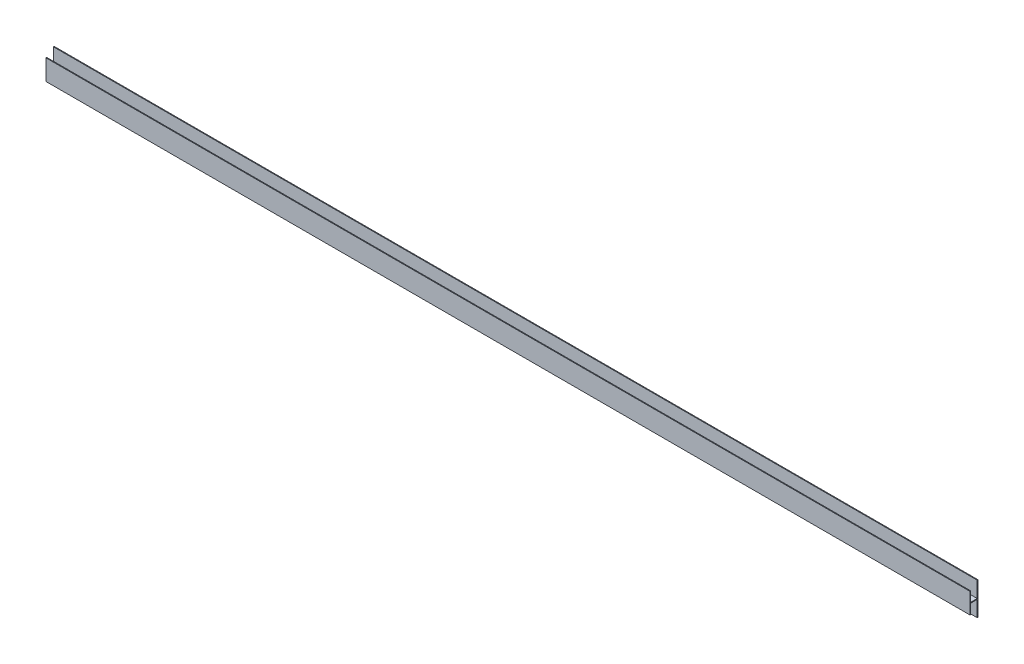
ISO-10303-21;
HEADER;
FILE_DESCRIPTION(('STEP AP214'),'2;1');
FILE_NAME('part.step','',(''),(''),'','','');
FILE_SCHEMA(('AUTOMOTIVE_DESIGN { 1 0 10303 214 1 1 1 1 }'));
ENDSEC;
DATA;
#1=APPLICATION_CONTEXT('core data for automotive mechanical design processes');
#2=APPLICATION_PROTOCOL_DEFINITION('international standard','automotive_design',2000,#1);
#3=PRODUCT_CONTEXT('',#1,'mechanical');
#4=PRODUCT('Part','Part','',(#3));
#5=PRODUCT_RELATED_PRODUCT_CATEGORY('part','',(#4));
#6=PRODUCT_DEFINITION_FORMATION('','',#4);
#7=PRODUCT_DEFINITION_CONTEXT('part definition',#1,'design');
#8=PRODUCT_DEFINITION('design','',#6,#7);
#9=PRODUCT_DEFINITION_SHAPE('','',#8);
#10=(LENGTH_UNIT() NAMED_UNIT(*) SI_UNIT(.MILLI.,.METRE.));
#11=(NAMED_UNIT(*) PLANE_ANGLE_UNIT() SI_UNIT($,.RADIAN.));
#12=(NAMED_UNIT(*) SI_UNIT($,.STERADIAN.) SOLID_ANGLE_UNIT());
#13=UNCERTAINTY_MEASURE_WITH_UNIT(LENGTH_MEASURE(1.E-05),#10,'distance_accuracy_value','');
#14=(GEOMETRIC_REPRESENTATION_CONTEXT(3) GLOBAL_UNCERTAINTY_ASSIGNED_CONTEXT((#13)) GLOBAL_UNIT_ASSIGNED_CONTEXT((#10,
#11,#12)) REPRESENTATION_CONTEXT('',''));
#15=CARTESIAN_POINT('',(0.,0.,0.));
#16=DIRECTION('',(0.,0.,1.));
#17=DIRECTION('',(1.,0.,0.));
#18=AXIS2_PLACEMENT_3D('',#15,#16,#17);
#19=CARTESIAN_POINT('',(901.7,-31.75,-7.85));
#20=DIRECTION('',(0.,1.,0.));
#21=DIRECTION('',(0.,0.,1.));
#22=AXIS2_PLACEMENT_3D('',#19,#20,#21);
#23=PLANE('',#22);
#24=DIRECTION('',(0.,0.,-1.));
#25=VECTOR('',#24,1.);
#26=CARTESIAN_POINT('',(-901.7,-31.75,-7.85));
#27=LINE('',#26,#25);
#28=CARTESIAN_POINT('',(-901.7,-31.75,-6.35));
#29=VERTEX_POINT('',#28);
#30=CARTESIAN_POINT('',(-901.7,-31.75,-7.85));
#31=VERTEX_POINT('',#30);
#32=EDGE_CURVE('E159',#29,#31,#27,.T.);
#33=ORIENTED_EDGE('',*,*,#32,.T.);
#34=DIRECTION('',(-1.,0.,0.));
#35=VECTOR('',#34,1.);
#36=CARTESIAN_POINT('',(901.7,-31.75,-7.85));
#37=LINE('',#36,#35);
#38=CARTESIAN_POINT('',(901.7,-31.75,-7.85));
#39=VERTEX_POINT('',#38);
#40=EDGE_CURVE('E11',#39,#31,#37,.T.);
#41=ORIENTED_EDGE('',*,*,#40,.F.);
#42=DIRECTION('',(0.,0.,-1.));
#43=VECTOR('',#42,1.);
#44=CARTESIAN_POINT('',(901.7,-31.75,-7.85));
#45=LINE('',#44,#43);
#46=CARTESIAN_POINT('',(901.7,-31.75,-6.35));
#47=VERTEX_POINT('',#46);
#48=EDGE_CURVE('E181',#47,#39,#45,.T.);
#49=ORIENTED_EDGE('',*,*,#48,.F.);
#50=DIRECTION('',(-1.,0.,0.));
#51=VECTOR('',#50,1.);
#52=CARTESIAN_POINT('',(901.7,-31.75,-6.35));
#53=LINE('',#52,#51);
#54=EDGE_CURVE('E155',#47,#29,#53,.T.);
#55=ORIENTED_EDGE('',*,*,#54,.T.);
#56=EDGE_LOOP('',(#33,#41,#49,#55));
#57=FACE_BOUND('',#56,.T.);
#58=ADVANCED_FACE('F39',(#57),#23,.F.);
#59=CARTESIAN_POINT('',(901.7,-31.75,-7.85));
#60=DIRECTION('',(0.,0.,1.));
#61=DIRECTION('',(1.,0.,0.));
#62=AXIS2_PLACEMENT_3D('',#59,#60,#61);
#63=PLANE('',#62);
#64=DIRECTION('',(0.,1.,0.));
#65=VECTOR('',#64,1.);
#66=CARTESIAN_POINT('',(-901.7,-31.75,-7.85));
#67=LINE('',#66,#65);
#68=CARTESIAN_POINT('',(-901.7,31.75,-7.85));
#69=VERTEX_POINT('',#68);
#70=EDGE_CURVE('E162',#31,#69,#67,.T.);
#71=ORIENTED_EDGE('',*,*,#70,.T.);
#72=DIRECTION('',(-1.,0.,0.));
#73=VECTOR('',#72,1.);
#74=CARTESIAN_POINT('',(901.7,31.75,-7.85));
#75=LINE('',#74,#73);
#76=CARTESIAN_POINT('',(901.7,31.75,-7.85));
#77=VERTEX_POINT('',#76);
#78=EDGE_CURVE('E47',#77,#69,#75,.T.);
#79=ORIENTED_EDGE('',*,*,#78,.F.);
#80=DIRECTION('',(0.,1.,0.));
#81=VECTOR('',#80,1.);
#82=CARTESIAN_POINT('',(901.7,-31.75,-7.85));
#83=LINE('',#82,#81);
#84=EDGE_CURVE('E110',#39,#77,#83,.T.);
#85=ORIENTED_EDGE('',*,*,#84,.F.);
#86=ORIENTED_EDGE('',*,*,#40,.T.);
#87=EDGE_LOOP('',(#71,#79,#85,#86));
#88=FACE_BOUND('',#87,.T.);
#89=ADVANCED_FACE('F259',(#88),#63,.F.);
#90=CARTESIAN_POINT('',(901.7,31.75,-7.85));
#91=DIRECTION('',(0.,-1.,0.));
#92=DIRECTION('',(0.,0.,-1.));
#93=AXIS2_PLACEMENT_3D('',#90,#91,#92);
#94=PLANE('',#93);
#95=DIRECTION('',(0.,0.,1.));
#96=VECTOR('',#95,1.);
#97=CARTESIAN_POINT('',(-901.7,31.75,-7.85));
#98=LINE('',#97,#96);
#99=CARTESIAN_POINT('',(-901.7,31.75,-6.35));
#100=VERTEX_POINT('',#99);
#101=EDGE_CURVE('E164',#69,#100,#98,.T.);
#102=ORIENTED_EDGE('',*,*,#101,.T.);
#103=DIRECTION('',(-1.,0.,0.));
#104=VECTOR('',#103,1.);
#105=CARTESIAN_POINT('',(901.7,31.75,-6.35));
#106=LINE('',#105,#104);
#107=CARTESIAN_POINT('',(901.7,31.75,-6.35));
#108=VERTEX_POINT('',#107);
#109=EDGE_CURVE('E200',#108,#100,#106,.T.);
#110=ORIENTED_EDGE('',*,*,#109,.F.);
#111=DIRECTION('',(0.,0.,1.));
#112=VECTOR('',#111,1.);
#113=CARTESIAN_POINT('',(901.7,31.75,-7.85));
#114=LINE('',#113,#112);
#115=EDGE_CURVE('E208',#77,#108,#114,.T.);
#116=ORIENTED_EDGE('',*,*,#115,.F.);
#117=ORIENTED_EDGE('',*,*,#78,.T.);
#118=EDGE_LOOP('',(#102,#110,#116,#117));
#119=FACE_BOUND('',#118,.T.);
#120=ADVANCED_FACE('F206',(#119),#94,.F.);
#121=CARTESIAN_POINT('',(901.7,0.749999999999999,-6.35));
#122=DIRECTION('',(0.,0.,-1.));
#123=DIRECTION('',(0.,1.,0.));
#124=AXIS2_PLACEMENT_3D('',#121,#122,#123);
#125=PLANE('',#124);
#126=DIRECTION('',(0.,-1.,0.));
#127=VECTOR('',#126,1.);
#128=CARTESIAN_POINT('',(-901.7,0.749999999999999,-6.35));
#129=LINE('',#128,#127);
#130=CARTESIAN_POINT('',(-901.7,0.749999999999999,-6.35));
#131=VERTEX_POINT('',#130);
#132=EDGE_CURVE('E166',#100,#131,#129,.T.);
#133=ORIENTED_EDGE('',*,*,#132,.T.);
#134=DIRECTION('',(-1.,0.,0.));
#135=VECTOR('',#134,1.);
#136=CARTESIAN_POINT('',(901.7,0.749999999999999,-6.35));
#137=LINE('',#136,#135);
#138=CARTESIAN_POINT('',(901.7,0.749999999999999,-6.35));
#139=VERTEX_POINT('',#138);
#140=EDGE_CURVE('E197',#139,#131,#137,.T.);
#141=ORIENTED_EDGE('',*,*,#140,.F.);
#142=DIRECTION('',(0.,-1.,0.));
#143=VECTOR('',#142,1.);
#144=CARTESIAN_POINT('',(901.7,0.749999999999999,-6.35));
#145=LINE('',#144,#143);
#146=EDGE_CURVE('E226',#108,#139,#145,.T.);
#147=ORIENTED_EDGE('',*,*,#146,.F.);
#148=ORIENTED_EDGE('',*,*,#109,.T.);
#149=EDGE_LOOP('',(#133,#141,#147,#148));
#150=FACE_BOUND('',#149,.T.);
#151=ADVANCED_FACE('F217',(#150),#125,.F.);
#152=CARTESIAN_POINT('',(901.7,0.750000000000001,6.35));
#153=DIRECTION('',(0.,-1.,0.));
#154=DIRECTION('',(0.,0.,-1.));
#155=AXIS2_PLACEMENT_3D('',#152,#153,#154);
#156=PLANE('',#155);
#157=DIRECTION('',(0.,0.,1.));
#158=VECTOR('',#157,1.);
#159=CARTESIAN_POINT('',(-901.7,0.750000000000001,6.35));
#160=LINE('',#159,#158);
#161=CARTESIAN_POINT('',(-901.7,0.750000000000001,6.35));
#162=VERTEX_POINT('',#161);
#163=EDGE_CURVE('E168',#131,#162,#160,.T.);
#164=ORIENTED_EDGE('',*,*,#163,.T.);
#165=DIRECTION('',(-1.,0.,0.));
#166=VECTOR('',#165,1.);
#167=CARTESIAN_POINT('',(901.7,0.750000000000001,6.35));
#168=LINE('',#167,#166);
#169=CARTESIAN_POINT('',(901.7,0.750000000000001,6.35));
#170=VERTEX_POINT('',#169);
#171=EDGE_CURVE('E194',#170,#162,#168,.T.);
#172=ORIENTED_EDGE('',*,*,#171,.F.);
#173=DIRECTION('',(0.,0.,1.));
#174=VECTOR('',#173,1.);
#175=CARTESIAN_POINT('',(901.7,0.750000000000001,6.35));
#176=LINE('',#175,#174);
#177=EDGE_CURVE('E223',#139,#170,#176,.T.);
#178=ORIENTED_EDGE('',*,*,#177,.F.);
#179=ORIENTED_EDGE('',*,*,#140,.T.);
#180=EDGE_LOOP('',(#164,#172,#178,#179));
#181=FACE_BOUND('',#180,.T.);
#182=ADVANCED_FACE('F221',(#181),#156,.F.);
#183=CARTESIAN_POINT('',(901.7,0.750000000000001,6.35));
#184=DIRECTION('',(0.,0.,1.));
#185=DIRECTION('',(1.,0.,0.));
#186=AXIS2_PLACEMENT_3D('',#183,#184,#185);
#187=PLANE('',#186);
#188=DIRECTION('',(0.,1.,0.));
#189=VECTOR('',#188,1.);
#190=CARTESIAN_POINT('',(-901.7,0.750000000000001,6.35));
#191=LINE('',#190,#189);
#192=CARTESIAN_POINT('',(-901.7,20.,6.35));
#193=VERTEX_POINT('',#192);
#194=EDGE_CURVE('E170',#162,#193,#191,.T.);
#195=ORIENTED_EDGE('',*,*,#194,.T.);
#196=DIRECTION('',(-1.,0.,0.));
#197=VECTOR('',#196,1.);
#198=CARTESIAN_POINT('',(901.7,20.,6.35));
#199=LINE('',#198,#197);
#200=CARTESIAN_POINT('',(901.7,20.,6.35));
#201=VERTEX_POINT('',#200);
#202=EDGE_CURVE('E191',#201,#193,#199,.T.);
#203=ORIENTED_EDGE('',*,*,#202,.F.);
#204=DIRECTION('',(0.,1.,0.));
#205=VECTOR('',#204,1.);
#206=CARTESIAN_POINT('',(901.7,0.750000000000001,6.35));
#207=LINE('',#206,#205);
#208=EDGE_CURVE('E225',#170,#201,#207,.T.);
#209=ORIENTED_EDGE('',*,*,#208,.F.);
#210=ORIENTED_EDGE('',*,*,#171,.T.);
#211=EDGE_LOOP('',(#195,#203,#209,#210));
#212=FACE_BOUND('',#211,.T.);
#213=ADVANCED_FACE('F272',(#212),#187,.F.);
#214=CARTESIAN_POINT('',(901.7,20.,6.35));
#215=DIRECTION('',(0.,-1.,0.));
#216=DIRECTION('',(0.,0.,-1.));
#217=AXIS2_PLACEMENT_3D('',#214,#215,#216);
#218=PLANE('',#217);
#219=DIRECTION('',(0.,0.,1.));
#220=VECTOR('',#219,1.);
#221=CARTESIAN_POINT('',(-901.7,20.,6.35));
#222=LINE('',#221,#220);
#223=CARTESIAN_POINT('',(-901.7,20.,7.85));
#224=VERTEX_POINT('',#223);
#225=EDGE_CURVE('E172',#193,#224,#222,.T.);
#226=ORIENTED_EDGE('',*,*,#225,.T.);
#227=DIRECTION('',(-1.,0.,0.));
#228=VECTOR('',#227,1.);
#229=CARTESIAN_POINT('',(901.7,20.,7.85));
#230=LINE('',#229,#228);
#231=CARTESIAN_POINT('',(901.7,20.,7.85));
#232=VERTEX_POINT('',#231);
#233=EDGE_CURVE('E188',#232,#224,#230,.T.);
#234=ORIENTED_EDGE('',*,*,#233,.F.);
#235=DIRECTION('',(0.,0.,1.));
#236=VECTOR('',#235,1.);
#237=CARTESIAN_POINT('',(901.7,20.,6.35));
#238=LINE('',#237,#236);
#239=EDGE_CURVE('E228',#201,#232,#238,.T.);
#240=ORIENTED_EDGE('',*,*,#239,.F.);
#241=ORIENTED_EDGE('',*,*,#202,.T.);
#242=EDGE_LOOP('',(#226,#234,#240,#241));
#243=FACE_BOUND('',#242,.T.);
#244=ADVANCED_FACE('F275',(#243),#218,.F.);
#245=CARTESIAN_POINT('',(901.7,-20.,7.85));
#246=DIRECTION('',(0.,0.,-1.));
#247=DIRECTION('',(-1.,0.,0.));
#248=AXIS2_PLACEMENT_3D('',#245,#246,#247);
#249=PLANE('',#248);
#250=DIRECTION('',(0.,-1.,0.));
#251=VECTOR('',#250,1.);
#252=CARTESIAN_POINT('',(-901.7,-20.,7.85));
#253=LINE('',#252,#251);
#254=CARTESIAN_POINT('',(-901.7,-20.,7.85));
#255=VERTEX_POINT('',#254);
#256=EDGE_CURVE('E174',#224,#255,#253,.T.);
#257=ORIENTED_EDGE('',*,*,#256,.T.);
#258=DIRECTION('',(-1.,0.,0.));
#259=VECTOR('',#258,1.);
#260=CARTESIAN_POINT('',(901.7,-20.,7.85));
#261=LINE('',#260,#259);
#262=CARTESIAN_POINT('',(901.7,-20.,7.85));
#263=VERTEX_POINT('',#262);
#264=EDGE_CURVE('E185',#263,#255,#261,.T.);
#265=ORIENTED_EDGE('',*,*,#264,.F.);
#266=DIRECTION('',(0.,-1.,0.));
#267=VECTOR('',#266,1.);
#268=CARTESIAN_POINT('',(901.7,-20.,7.85));
#269=LINE('',#268,#267);
#270=EDGE_CURVE('E234',#232,#263,#269,.T.);
#271=ORIENTED_EDGE('',*,*,#270,.F.);
#272=ORIENTED_EDGE('',*,*,#233,.T.);
#273=EDGE_LOOP('',(#257,#265,#271,#272));
#274=FACE_BOUND('',#273,.T.);
#275=ADVANCED_FACE('F240',(#274),#249,.F.);
#276=CARTESIAN_POINT('',(901.7,-20.,6.35));
#277=DIRECTION('',(0.,1.,0.));
#278=DIRECTION('',(0.,0.,1.));
#279=AXIS2_PLACEMENT_3D('',#276,#277,#278);
#280=PLANE('',#279);
#281=DIRECTION('',(0.,0.,-1.));
#282=VECTOR('',#281,1.);
#283=CARTESIAN_POINT('',(-901.7,-20.,6.35));
#284=LINE('',#283,#282);
#285=CARTESIAN_POINT('',(-901.7,-20.,6.35));
#286=VERTEX_POINT('',#285);
#287=EDGE_CURVE('E176',#255,#286,#284,.T.);
#288=ORIENTED_EDGE('',*,*,#287,.T.);
#289=DIRECTION('',(-1.,0.,0.));
#290=VECTOR('',#289,1.);
#291=CARTESIAN_POINT('',(901.7,-20.,6.35));
#292=LINE('',#291,#290);
#293=CARTESIAN_POINT('',(901.7,-20.,6.35));
#294=VERTEX_POINT('',#293);
#295=EDGE_CURVE('E150',#294,#286,#292,.T.);
#296=ORIENTED_EDGE('',*,*,#295,.F.);
#297=DIRECTION('',(0.,0.,-1.));
#298=VECTOR('',#297,1.);
#299=CARTESIAN_POINT('',(901.7,-20.,6.35));
#300=LINE('',#299,#298);
#301=EDGE_CURVE('E141',#263,#294,#300,.T.);
#302=ORIENTED_EDGE('',*,*,#301,.F.);
#303=ORIENTED_EDGE('',*,*,#264,.T.);
#304=EDGE_LOOP('',(#288,#296,#302,#303));
#305=FACE_BOUND('',#304,.T.);
#306=ADVANCED_FACE('F244',(#305),#280,.F.);
#307=CARTESIAN_POINT('',(901.7,-20.,6.35));
#308=DIRECTION('',(0.,0.,1.));
#309=DIRECTION('',(1.,0.,0.));
#310=AXIS2_PLACEMENT_3D('',#307,#308,#309);
#311=PLANE('',#310);
#312=DIRECTION('',(0.,1.,0.));
#313=VECTOR('',#312,1.);
#314=CARTESIAN_POINT('',(-901.7,-20.,6.35));
#315=LINE('',#314,#313);
#316=CARTESIAN_POINT('',(-901.7,-0.75,6.35));
#317=VERTEX_POINT('',#316);
#318=EDGE_CURVE('E149',#286,#317,#315,.T.);
#319=ORIENTED_EDGE('',*,*,#318,.T.);
#320=DIRECTION('',(-1.,0.,0.));
#321=VECTOR('',#320,1.);
#322=CARTESIAN_POINT('',(901.7,-0.75,6.35));
#323=LINE('',#322,#321);
#324=CARTESIAN_POINT('',(901.7,-0.75,6.35));
#325=VERTEX_POINT('',#324);
#326=EDGE_CURVE('E146',#325,#317,#323,.T.);
#327=ORIENTED_EDGE('',*,*,#326,.F.);
#328=DIRECTION('',(0.,1.,0.));
#329=VECTOR('',#328,1.);
#330=CARTESIAN_POINT('',(901.7,-20.,6.35));
#331=LINE('',#330,#329);
#332=EDGE_CURVE('E135',#294,#325,#331,.T.);
#333=ORIENTED_EDGE('',*,*,#332,.F.);
#334=ORIENTED_EDGE('',*,*,#295,.T.);
#335=EDGE_LOOP('',(#319,#327,#333,#334));
#336=FACE_BOUND('',#335,.T.);
#337=ADVANCED_FACE('F147',(#336),#311,.F.);
#338=CARTESIAN_POINT('',(901.7,-0.75,6.35));
#339=DIRECTION('',(0.,1.,0.));
#340=DIRECTION('',(0.,0.,1.));
#341=AXIS2_PLACEMENT_3D('',#338,#339,#340);
#342=PLANE('',#341);
#343=DIRECTION('',(0.,0.,-1.));
#344=VECTOR('',#343,1.);
#345=CARTESIAN_POINT('',(-901.7,-0.75,6.35));
#346=LINE('',#345,#344);
#347=CARTESIAN_POINT('',(-901.7,-0.75,-6.35));
#348=VERTEX_POINT('',#347);
#349=EDGE_CURVE('E96',#317,#348,#346,.T.);
#350=ORIENTED_EDGE('',*,*,#349,.T.);
#351=DIRECTION('',(-1.,0.,0.));
#352=VECTOR('',#351,1.);
#353=CARTESIAN_POINT('',(901.7,-0.75,-6.35));
#354=LINE('',#353,#352);
#355=CARTESIAN_POINT('',(901.7,-0.75,-6.35));
#356=VERTEX_POINT('',#355);
#357=EDGE_CURVE('E151',#356,#348,#354,.T.);
#358=ORIENTED_EDGE('',*,*,#357,.F.);
#359=DIRECTION('',(0.,0.,-1.));
#360=VECTOR('',#359,1.);
#361=CARTESIAN_POINT('',(901.7,-0.75,6.35));
#362=LINE('',#361,#360);
#363=EDGE_CURVE('E139',#325,#356,#362,.T.);
#364=ORIENTED_EDGE('',*,*,#363,.F.);
#365=ORIENTED_EDGE('',*,*,#326,.T.);
#366=EDGE_LOOP('',(#350,#358,#364,#365));
#367=FACE_BOUND('',#366,.T.);
#368=ADVANCED_FACE('F153',(#367),#342,.F.);
#369=CARTESIAN_POINT('',(901.7,-31.75,-6.35));
#370=DIRECTION('',(0.,0.,-1.));
#371=DIRECTION('',(-1.,0.,0.));
#372=AXIS2_PLACEMENT_3D('',#369,#370,#371);
#373=PLANE('',#372);
#374=DIRECTION('',(0.,-1.,0.));
#375=VECTOR('',#374,1.);
#376=CARTESIAN_POINT('',(-901.7,-31.75,-6.35));
#377=LINE('',#376,#375);
#378=EDGE_CURVE('E102',#348,#29,#377,.T.);
#379=ORIENTED_EDGE('',*,*,#378,.T.);
#380=ORIENTED_EDGE('',*,*,#54,.F.);
#381=DIRECTION('',(0.,-1.,0.));
#382=VECTOR('',#381,1.);
#383=CARTESIAN_POINT('',(901.7,-31.75,-6.35));
#384=LINE('',#383,#382);
#385=EDGE_CURVE('E55',#356,#47,#384,.T.);
#386=ORIENTED_EDGE('',*,*,#385,.F.);
#387=ORIENTED_EDGE('',*,*,#357,.T.);
#388=EDGE_LOOP('',(#379,#380,#386,#387));
#389=FACE_BOUND('',#388,.T.);
#390=ADVANCED_FACE('F248',(#389),#373,.F.);
#391=CARTESIAN_POINT('',(901.7,0.,0.));
#392=DIRECTION('',(-1.,0.,0.));
#393=DIRECTION('',(0.,0.,1.));
#394=AXIS2_PLACEMENT_3D('',#391,#392,#393);
#395=PLANE('',#394);
#396=ORIENTED_EDGE('',*,*,#48,.T.);
#397=ORIENTED_EDGE('',*,*,#84,.T.);
#398=ORIENTED_EDGE('',*,*,#115,.T.);
#399=ORIENTED_EDGE('',*,*,#146,.T.);
#400=ORIENTED_EDGE('',*,*,#177,.T.);
#401=ORIENTED_EDGE('',*,*,#208,.T.);
#402=ORIENTED_EDGE('',*,*,#239,.T.);
#403=ORIENTED_EDGE('',*,*,#270,.T.);
#404=ORIENTED_EDGE('',*,*,#301,.T.);
#405=ORIENTED_EDGE('',*,*,#332,.T.);
#406=ORIENTED_EDGE('',*,*,#363,.T.);
#407=ORIENTED_EDGE('',*,*,#385,.T.);
#408=EDGE_LOOP('',(#396,#397,#398,#399,#400,#401,#402,#403,#404,#405,#406,#407));
#409=FACE_BOUND('',#408,.T.);
#410=ADVANCED_FACE('F137',(#409),#395,.F.);
#411=CARTESIAN_POINT('',(-901.7,0.,0.));
#412=DIRECTION('',(-1.,0.,0.));
#413=DIRECTION('',(0.,0.,1.));
#414=AXIS2_PLACEMENT_3D('',#411,#412,#413);
#415=PLANE('',#414);
#416=ORIENTED_EDGE('',*,*,#32,.F.);
#417=ORIENTED_EDGE('',*,*,#378,.F.);
#418=ORIENTED_EDGE('',*,*,#349,.F.);
#419=ORIENTED_EDGE('',*,*,#318,.F.);
#420=ORIENTED_EDGE('',*,*,#287,.F.);
#421=ORIENTED_EDGE('',*,*,#256,.F.);
#422=ORIENTED_EDGE('',*,*,#225,.F.);
#423=ORIENTED_EDGE('',*,*,#194,.F.);
#424=ORIENTED_EDGE('',*,*,#163,.F.);
#425=ORIENTED_EDGE('',*,*,#132,.F.);
#426=ORIENTED_EDGE('',*,*,#101,.F.);
#427=ORIENTED_EDGE('',*,*,#70,.F.);
#428=EDGE_LOOP('',(#416,#417,#418,#419,#420,#421,#422,#423,#424,#425,#426,#427));
#429=FACE_BOUND('',#428,.T.);
#430=ADVANCED_FACE('F212',(#429),#415,.T.);
#431=CLOSED_SHELL('',(#58,#89,#120,#151,#182,#213,#244,#275,#306,#337,#368,#390,#410,#430));
#432=MANIFOLD_SOLID_BREP('B2',#431);
#433=ADVANCED_BREP_SHAPE_REPRESENTATION('',(#18,#432),#14);
#434=SHAPE_DEFINITION_REPRESENTATION(#9,#433);
ENDSEC;
END-ISO-10303-21;
